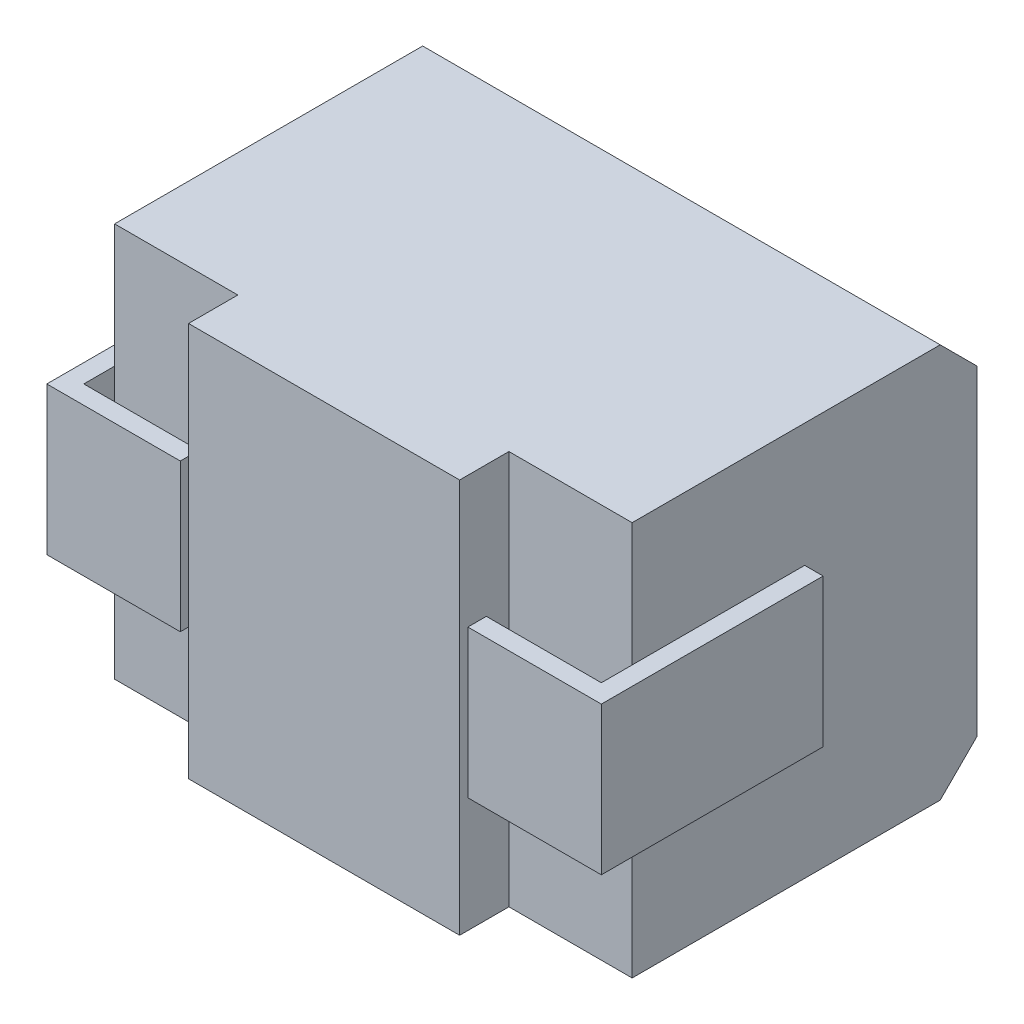
ISO-10303-21;
HEADER;
FILE_DESCRIPTION(('STEP AP214'),'2;1');
FILE_NAME('part.step','',(''),(''),'','','');
FILE_SCHEMA(('AUTOMOTIVE_DESIGN { 1 0 10303 214 1 1 1 1 }'));
ENDSEC;
DATA;
#1=APPLICATION_CONTEXT('core data for automotive mechanical design processes');
#2=APPLICATION_PROTOCOL_DEFINITION('international standard','automotive_design',2000,#1);
#3=PRODUCT_CONTEXT('',#1,'mechanical');
#4=PRODUCT('Part','Part','',(#3));
#5=PRODUCT_RELATED_PRODUCT_CATEGORY('part','',(#4));
#6=PRODUCT_DEFINITION_FORMATION('','',#4);
#7=PRODUCT_DEFINITION_CONTEXT('part definition',#1,'design');
#8=PRODUCT_DEFINITION('design','',#6,#7);
#9=PRODUCT_DEFINITION_SHAPE('','',#8);
#10=(LENGTH_UNIT() NAMED_UNIT(*) SI_UNIT(.MILLI.,.METRE.));
#11=(NAMED_UNIT(*) PLANE_ANGLE_UNIT() SI_UNIT($,.RADIAN.));
#12=(NAMED_UNIT(*) SI_UNIT($,.STERADIAN.) SOLID_ANGLE_UNIT());
#13=UNCERTAINTY_MEASURE_WITH_UNIT(LENGTH_MEASURE(1.E-05),#10,'distance_accuracy_value','');
#14=(GEOMETRIC_REPRESENTATION_CONTEXT(3) GLOBAL_UNCERTAINTY_ASSIGNED_CONTEXT((#13)) GLOBAL_UNIT_ASSIGNED_CONTEXT((#10,
#11,#12)) REPRESENTATION_CONTEXT('',''));
#15=CARTESIAN_POINT('',(0.,0.,0.));
#16=DIRECTION('',(0.,0.,1.));
#17=DIRECTION('',(1.,0.,0.));
#18=AXIS2_PLACEMENT_3D('',#15,#16,#17);
#19=CARTESIAN_POINT('',(0.,3.2,-0.4));
#20=DIRECTION('',(1.,0.,0.));
#21=DIRECTION('',(0.,0.,-1.));
#22=AXIS2_PLACEMENT_3D('',#19,#20,#21);
#23=PLANE('',#22);
#24=DIRECTION('',(0.,-1.,0.));
#25=VECTOR('',#24,1.);
#26=CARTESIAN_POINT('',(0.,3.2,-3.2));
#27=LINE('',#26,#25);
#28=CARTESIAN_POINT('',(0.,2.9,-3.2));
#29=VERTEX_POINT('',#28);
#30=CARTESIAN_POINT('',(0.,0.300000000000001,-3.2));
#31=VERTEX_POINT('',#30);
#32=EDGE_CURVE('E11',#29,#31,#27,.T.);
#33=ORIENTED_EDGE('',*,*,#32,.T.);
#34=DIRECTION('',(0.,-0.707106781186547,0.707106781186549));
#35=VECTOR('',#34,1.);
#36=CARTESIAN_POINT('',(0.,0.3,-3.2));
#37=LINE('',#36,#35);
#38=CARTESIAN_POINT('',(0.,0.,-2.9));
#39=VERTEX_POINT('',#38);
#40=EDGE_CURVE('E24',#31,#39,#37,.T.);
#41=ORIENTED_EDGE('',*,*,#40,.T.);
#42=DIRECTION('',(0.,0.,1.));
#43=VECTOR('',#42,1.);
#44=CARTESIAN_POINT('',(0.,0.,-0.4));
#45=LINE('',#44,#43);
#46=CARTESIAN_POINT('',(0.,0.,-0.4));
#47=VERTEX_POINT('',#46);
#48=EDGE_CURVE('E383',#39,#47,#45,.T.);
#49=ORIENTED_EDGE('',*,*,#48,.T.);
#50=DIRECTION('',(0.,-1.,0.));
#51=VECTOR('',#50,1.);
#52=CARTESIAN_POINT('',(0.,3.2,-0.4));
#53=LINE('',#52,#51);
#54=CARTESIAN_POINT('',(0.,1.,-0.4));
#55=VERTEX_POINT('',#54);
#56=EDGE_CURVE('E380',#55,#47,#53,.T.);
#57=ORIENTED_EDGE('',*,*,#56,.F.);
#58=DIRECTION('',(0.,0.,-1.));
#59=VECTOR('',#58,1.);
#60=CARTESIAN_POINT('',(0.,1.,-0.149999999999998));
#61=LINE('',#60,#59);
#62=CARTESIAN_POINT('',(0.,1.,-1.8));
#63=VERTEX_POINT('',#62);
#64=EDGE_CURVE('E378',#55,#63,#61,.T.);
#65=ORIENTED_EDGE('',*,*,#64,.T.);
#66=DIRECTION('',(0.,1.,0.));
#67=VECTOR('',#66,1.);
#68=CARTESIAN_POINT('',(0.,1.,-1.8));
#69=LINE('',#68,#67);
#70=CARTESIAN_POINT('',(0.,2.2,-1.8));
#71=VERTEX_POINT('',#70);
#72=EDGE_CURVE('E200',#63,#71,#69,.T.);
#73=ORIENTED_EDGE('',*,*,#72,.T.);
#74=DIRECTION('',(0.,0.,-1.));
#75=VECTOR('',#74,1.);
#76=CARTESIAN_POINT('',(0.,2.2,-0.149999999999998));
#77=LINE('',#76,#75);
#78=CARTESIAN_POINT('',(0.,2.2,-0.4));
#79=VERTEX_POINT('',#78);
#80=EDGE_CURVE('E374',#79,#71,#77,.T.);
#81=ORIENTED_EDGE('',*,*,#80,.F.);
#82=DIRECTION('',(0.,-1.,0.));
#83=VECTOR('',#82,1.);
#84=CARTESIAN_POINT('',(0.,3.2,-0.4));
#85=LINE('',#84,#83);
#86=CARTESIAN_POINT('',(0.,3.2,-0.4));
#87=VERTEX_POINT('',#86);
#88=EDGE_CURVE('E371',#87,#79,#85,.T.);
#89=ORIENTED_EDGE('',*,*,#88,.F.);
#90=DIRECTION('',(0.,0.,1.));
#91=VECTOR('',#90,1.);
#92=CARTESIAN_POINT('',(0.,3.2,-0.4));
#93=LINE('',#92,#91);
#94=CARTESIAN_POINT('',(0.,3.2,-2.9));
#95=VERTEX_POINT('',#94);
#96=EDGE_CURVE('E368',#95,#87,#93,.T.);
#97=ORIENTED_EDGE('',*,*,#96,.F.);
#98=DIRECTION('',(0.,-0.707106781186548,-0.707106781186548));
#99=VECTOR('',#98,1.);
#100=CARTESIAN_POINT('',(0.,3.2,-2.9));
#101=LINE('',#100,#99);
#102=EDGE_CURVE('E366',#95,#29,#101,.T.);
#103=ORIENTED_EDGE('',*,*,#102,.T.);
#104=EDGE_LOOP('',(#33,#41,#49,#57,#65,#73,#81,#89,#97,#103));
#105=FACE_BOUND('',#104,.T.);
#106=ADVANCED_FACE('F17',(#105),#23,.F.);
#107=CARTESIAN_POINT('',(4.2,3.2,-0.400000000000001));
#108=DIRECTION('',(-1.,0.,0.));
#109=DIRECTION('',(0.,0.,1.));
#110=AXIS2_PLACEMENT_3D('',#107,#108,#109);
#111=PLANE('',#110);
#112=DIRECTION('',(0.,0.,-1.));
#113=VECTOR('',#112,1.);
#114=CARTESIAN_POINT('',(4.2,0.,-0.400000000000001));
#115=LINE('',#114,#113);
#116=CARTESIAN_POINT('',(4.2,0.,-0.400000000000001));
#117=VERTEX_POINT('',#116);
#118=CARTESIAN_POINT('',(4.2,0.,-2.9));
#119=VERTEX_POINT('',#118);
#120=EDGE_CURVE('E364',#117,#119,#115,.T.);
#121=ORIENTED_EDGE('',*,*,#120,.T.);
#122=DIRECTION('',(0.,0.707106781186547,-0.707106781186549));
#123=VECTOR('',#122,1.);
#124=CARTESIAN_POINT('',(4.2,0.300000000000001,-3.2));
#125=LINE('',#124,#123);
#126=CARTESIAN_POINT('',(4.2,0.3,-3.2));
#127=VERTEX_POINT('',#126);
#128=EDGE_CURVE('E362',#119,#127,#125,.T.);
#129=ORIENTED_EDGE('',*,*,#128,.T.);
#130=DIRECTION('',(0.,-1.,0.));
#131=VECTOR('',#130,1.);
#132=CARTESIAN_POINT('',(4.2,3.2,-3.2));
#133=LINE('',#132,#131);
#134=CARTESIAN_POINT('',(4.2,2.9,-3.2));
#135=VERTEX_POINT('',#134);
#136=EDGE_CURVE('E359',#135,#127,#133,.T.);
#137=ORIENTED_EDGE('',*,*,#136,.F.);
#138=DIRECTION('',(0.,0.707106781186548,0.707106781186548));
#139=VECTOR('',#138,1.);
#140=CARTESIAN_POINT('',(4.2,3.2,-2.9));
#141=LINE('',#140,#139);
#142=CARTESIAN_POINT('',(4.2,3.2,-2.9));
#143=VERTEX_POINT('',#142);
#144=EDGE_CURVE('E357',#135,#143,#141,.T.);
#145=ORIENTED_EDGE('',*,*,#144,.T.);
#146=DIRECTION('',(0.,0.,-1.));
#147=VECTOR('',#146,1.);
#148=CARTESIAN_POINT('',(4.2,3.2,-0.400000000000001));
#149=LINE('',#148,#147);
#150=CARTESIAN_POINT('',(4.2,3.2,-0.400000000000001));
#151=VERTEX_POINT('',#150);
#152=EDGE_CURVE('E354',#151,#143,#149,.T.);
#153=ORIENTED_EDGE('',*,*,#152,.F.);
#154=DIRECTION('',(0.,-1.,0.));
#155=VECTOR('',#154,1.);
#156=CARTESIAN_POINT('',(4.2,3.2,-0.400000000000001));
#157=LINE('',#156,#155);
#158=CARTESIAN_POINT('',(4.2,2.2,-0.400000000000001));
#159=VERTEX_POINT('',#158);
#160=EDGE_CURVE('E352',#151,#159,#157,.T.);
#161=ORIENTED_EDGE('',*,*,#160,.T.);
#162=DIRECTION('',(0.,0.,1.));
#163=VECTOR('',#162,1.);
#164=CARTESIAN_POINT('',(4.2,2.2,-0.15));
#165=LINE('',#164,#163);
#166=CARTESIAN_POINT('',(4.2,2.2,-1.8));
#167=VERTEX_POINT('',#166);
#168=EDGE_CURVE('E349',#167,#159,#165,.T.);
#169=ORIENTED_EDGE('',*,*,#168,.F.);
#170=DIRECTION('',(0.,1.,0.));
#171=VECTOR('',#170,1.);
#172=CARTESIAN_POINT('',(4.2,1.,-1.8));
#173=LINE('',#172,#171);
#174=CARTESIAN_POINT('',(4.2,1.,-1.8));
#175=VERTEX_POINT('',#174);
#176=EDGE_CURVE('E346',#175,#167,#173,.T.);
#177=ORIENTED_EDGE('',*,*,#176,.F.);
#178=DIRECTION('',(0.,0.,1.));
#179=VECTOR('',#178,1.);
#180=CARTESIAN_POINT('',(4.2,1.,-0.15));
#181=LINE('',#180,#179);
#182=CARTESIAN_POINT('',(4.2,1.,-0.400000000000001));
#183=VERTEX_POINT('',#182);
#184=EDGE_CURVE('E344',#175,#183,#181,.T.);
#185=ORIENTED_EDGE('',*,*,#184,.T.);
#186=DIRECTION('',(0.,-1.,0.));
#187=VECTOR('',#186,1.);
#188=CARTESIAN_POINT('',(4.2,3.2,-0.400000000000001));
#189=LINE('',#188,#187);
#190=EDGE_CURVE('E341',#183,#117,#189,.T.);
#191=ORIENTED_EDGE('',*,*,#190,.T.);
#192=EDGE_LOOP('',(#121,#129,#137,#145,#153,#161,#169,#177,#185,#191));
#193=FACE_BOUND('',#192,.T.);
#194=ADVANCED_FACE('F395',(#193),#111,.F.);
#195=CARTESIAN_POINT('',(0.,3.2,-3.2));
#196=DIRECTION('',(0.,0.,1.));
#197=DIRECTION('',(1.,0.,0.));
#198=AXIS2_PLACEMENT_3D('',#195,#196,#197);
#199=PLANE('',#198);
#200=ORIENTED_EDGE('',*,*,#136,.T.);
#201=DIRECTION('',(-1.,0.,0.));
#202=VECTOR('',#201,1.);
#203=CARTESIAN_POINT('',(0.,0.3,-3.2));
#204=LINE('',#203,#202);
#205=EDGE_CURVE('E339',#127,#31,#204,.T.);
#206=ORIENTED_EDGE('',*,*,#205,.T.);
#207=ORIENTED_EDGE('',*,*,#32,.F.);
#208=DIRECTION('',(1.,0.,0.));
#209=VECTOR('',#208,1.);
#210=CARTESIAN_POINT('',(0.,2.9,-3.2));
#211=LINE('',#210,#209);
#212=EDGE_CURVE('E337',#29,#135,#211,.T.);
#213=ORIENTED_EDGE('',*,*,#212,.T.);
#214=EDGE_LOOP('',(#200,#206,#207,#213));
#215=FACE_BOUND('',#214,.T.);
#216=ADVANCED_FACE('F397',(#215),#199,.F.);
#217=CARTESIAN_POINT('',(0.,3.2,-0.4));
#218=DIRECTION('',(0.,0.,-1.));
#219=DIRECTION('',(-1.,0.,0.));
#220=AXIS2_PLACEMENT_3D('',#217,#218,#219);
#221=PLANE('',#220);
#222=DIRECTION('',(1.,0.,0.));
#223=VECTOR('',#222,1.);
#224=CARTESIAN_POINT('',(0.,0.,-0.4));
#225=LINE('',#224,#223);
#226=CARTESIAN_POINT('',(0.999999999999999,0.,-0.4));
#227=VERTEX_POINT('',#226);
#228=EDGE_CURVE('E335',#47,#227,#225,.T.);
#229=ORIENTED_EDGE('',*,*,#228,.T.);
#230=DIRECTION('',(0.,-1.,0.));
#231=VECTOR('',#230,1.);
#232=CARTESIAN_POINT('',(0.999999999999999,3.2,-0.4));
#233=LINE('',#232,#231);
#234=CARTESIAN_POINT('',(0.999999999999999,3.2,-0.4));
#235=VERTEX_POINT('',#234);
#236=EDGE_CURVE('E332',#235,#227,#233,.T.);
#237=ORIENTED_EDGE('',*,*,#236,.F.);
#238=DIRECTION('',(1.,0.,0.));
#239=VECTOR('',#238,1.);
#240=CARTESIAN_POINT('',(0.,3.2,-0.4));
#241=LINE('',#240,#239);
#242=EDGE_CURVE('E329',#87,#235,#241,.T.);
#243=ORIENTED_EDGE('',*,*,#242,.F.);
#244=ORIENTED_EDGE('',*,*,#88,.T.);
#245=DIRECTION('',(0.,-1.,0.));
#246=VECTOR('',#245,1.);
#247=CARTESIAN_POINT('',(0.,3.2,-0.4));
#248=LINE('',#247,#246);
#249=EDGE_CURVE('E326',#79,#55,#248,.T.);
#250=ORIENTED_EDGE('',*,*,#249,.T.);
#251=ORIENTED_EDGE('',*,*,#56,.T.);
#252=EDGE_LOOP('',(#229,#237,#243,#244,#250,#251));
#253=FACE_BOUND('',#252,.T.);
#254=ADVANCED_FACE('F455',(#253),#221,.F.);
#255=CARTESIAN_POINT('',(0.999999999999999,3.2,-0.4));
#256=DIRECTION('',(1.,0.,0.));
#257=DIRECTION('',(0.,0.,-1.));
#258=AXIS2_PLACEMENT_3D('',#255,#256,#257);
#259=PLANE('',#258);
#260=DIRECTION('',(0.,0.,1.));
#261=VECTOR('',#260,1.);
#262=CARTESIAN_POINT('',(0.999999999999999,0.,-0.4));
#263=LINE('',#262,#261);
#264=CARTESIAN_POINT('',(1.,0.,0.));
#265=VERTEX_POINT('',#264);
#266=EDGE_CURVE('E324',#227,#265,#263,.T.);
#267=ORIENTED_EDGE('',*,*,#266,.T.);
#268=DIRECTION('',(0.,-1.,0.));
#269=VECTOR('',#268,1.);
#270=CARTESIAN_POINT('',(1.,3.2,0.));
#271=LINE('',#270,#269);
#272=CARTESIAN_POINT('',(1.,3.2,0.));
#273=VERTEX_POINT('',#272);
#274=EDGE_CURVE('E321',#273,#265,#271,.T.);
#275=ORIENTED_EDGE('',*,*,#274,.F.);
#276=DIRECTION('',(0.,0.,1.));
#277=VECTOR('',#276,1.);
#278=CARTESIAN_POINT('',(0.999999999999999,3.2,-0.4));
#279=LINE('',#278,#277);
#280=EDGE_CURVE('E318',#235,#273,#279,.T.);
#281=ORIENTED_EDGE('',*,*,#280,.F.);
#282=ORIENTED_EDGE('',*,*,#236,.T.);
#283=EDGE_LOOP('',(#267,#275,#281,#282));
#284=FACE_BOUND('',#283,.T.);
#285=ADVANCED_FACE('F460',(#284),#259,.F.);
#286=CARTESIAN_POINT('',(1.,3.2,0.));
#287=DIRECTION('',(0.,0.,-1.));
#288=DIRECTION('',(-1.,0.,0.));
#289=AXIS2_PLACEMENT_3D('',#286,#287,#288);
#290=PLANE('',#289);
#291=DIRECTION('',(1.,0.,0.));
#292=VECTOR('',#291,1.);
#293=CARTESIAN_POINT('',(1.,0.,0.));
#294=LINE('',#293,#292);
#295=CARTESIAN_POINT('',(3.2,0.,0.));
#296=VERTEX_POINT('',#295);
#297=EDGE_CURVE('E316',#265,#296,#294,.T.);
#298=ORIENTED_EDGE('',*,*,#297,.T.);
#299=DIRECTION('',(0.,-1.,0.));
#300=VECTOR('',#299,1.);
#301=CARTESIAN_POINT('',(3.2,3.2,0.));
#302=LINE('',#301,#300);
#303=CARTESIAN_POINT('',(3.2,3.2,0.));
#304=VERTEX_POINT('',#303);
#305=EDGE_CURVE('E313',#304,#296,#302,.T.);
#306=ORIENTED_EDGE('',*,*,#305,.F.);
#307=DIRECTION('',(1.,0.,0.));
#308=VECTOR('',#307,1.);
#309=CARTESIAN_POINT('',(1.,3.2,0.));
#310=LINE('',#309,#308);
#311=EDGE_CURVE('E310',#273,#304,#310,.T.);
#312=ORIENTED_EDGE('',*,*,#311,.F.);
#313=ORIENTED_EDGE('',*,*,#274,.T.);
#314=EDGE_LOOP('',(#298,#306,#312,#313));
#315=FACE_BOUND('',#314,.T.);
#316=ADVANCED_FACE('F464',(#315),#290,.F.);
#317=CARTESIAN_POINT('',(3.2,3.2,-0.4));
#318=DIRECTION('',(-1.,0.,0.));
#319=DIRECTION('',(0.,0.,1.));
#320=AXIS2_PLACEMENT_3D('',#317,#318,#319);
#321=PLANE('',#320);
#322=DIRECTION('',(0.,0.,-1.));
#323=VECTOR('',#322,1.);
#324=CARTESIAN_POINT('',(3.2,0.,-0.4));
#325=LINE('',#324,#323);
#326=CARTESIAN_POINT('',(3.2,0.,-0.4));
#327=VERTEX_POINT('',#326);
#328=EDGE_CURVE('E308',#296,#327,#325,.T.);
#329=ORIENTED_EDGE('',*,*,#328,.T.);
#330=DIRECTION('',(0.,-1.,0.));
#331=VECTOR('',#330,1.);
#332=CARTESIAN_POINT('',(3.2,3.2,-0.4));
#333=LINE('',#332,#331);
#334=CARTESIAN_POINT('',(3.2,3.2,-0.4));
#335=VERTEX_POINT('',#334);
#336=EDGE_CURVE('E305',#335,#327,#333,.T.);
#337=ORIENTED_EDGE('',*,*,#336,.F.);
#338=DIRECTION('',(0.,0.,-1.));
#339=VECTOR('',#338,1.);
#340=CARTESIAN_POINT('',(3.2,3.2,-0.4));
#341=LINE('',#340,#339);
#342=EDGE_CURVE('E302',#304,#335,#341,.T.);
#343=ORIENTED_EDGE('',*,*,#342,.F.);
#344=ORIENTED_EDGE('',*,*,#305,.T.);
#345=EDGE_LOOP('',(#329,#337,#343,#344));
#346=FACE_BOUND('',#345,.T.);
#347=ADVANCED_FACE('F468',(#346),#321,.F.);
#348=CARTESIAN_POINT('',(4.2,3.2,-0.400000000000001));
#349=DIRECTION('',(0.,0.,-1.));
#350=DIRECTION('',(-1.,0.,0.));
#351=AXIS2_PLACEMENT_3D('',#348,#349,#350);
#352=PLANE('',#351);
#353=DIRECTION('',(1.,0.,0.));
#354=VECTOR('',#353,1.);
#355=CARTESIAN_POINT('',(4.2,0.,-0.400000000000001));
#356=LINE('',#355,#354);
#357=EDGE_CURVE('E299',#327,#117,#356,.T.);
#358=ORIENTED_EDGE('',*,*,#357,.T.);
#359=ORIENTED_EDGE('',*,*,#190,.F.);
#360=DIRECTION('',(0.,-1.,0.));
#361=VECTOR('',#360,1.);
#362=CARTESIAN_POINT('',(4.2,3.2,-0.400000000000001));
#363=LINE('',#362,#361);
#364=EDGE_CURVE('E296',#159,#183,#363,.T.);
#365=ORIENTED_EDGE('',*,*,#364,.F.);
#366=ORIENTED_EDGE('',*,*,#160,.F.);
#367=DIRECTION('',(1.,0.,0.));
#368=VECTOR('',#367,1.);
#369=CARTESIAN_POINT('',(4.2,3.2,-0.400000000000001));
#370=LINE('',#369,#368);
#371=EDGE_CURVE('E293',#335,#151,#370,.T.);
#372=ORIENTED_EDGE('',*,*,#371,.F.);
#373=ORIENTED_EDGE('',*,*,#336,.T.);
#374=EDGE_LOOP('',(#358,#359,#365,#366,#372,#373));
#375=FACE_BOUND('',#374,.T.);
#376=ADVANCED_FACE('F409',(#375),#352,.F.);
#377=CARTESIAN_POINT('',(4.2,3.2,-3.2));
#378=DIRECTION('',(0.,-1.,0.));
#379=DIRECTION('',(0.,0.,-1.));
#380=AXIS2_PLACEMENT_3D('',#377,#378,#379);
#381=PLANE('',#380);
#382=ORIENTED_EDGE('',*,*,#152,.T.);
#383=DIRECTION('',(-1.,0.,0.));
#384=VECTOR('',#383,1.);
#385=CARTESIAN_POINT('',(4.2,3.2,-2.9));
#386=LINE('',#385,#384);
#387=EDGE_CURVE('E290',#143,#95,#386,.T.);
#388=ORIENTED_EDGE('',*,*,#387,.T.);
#389=ORIENTED_EDGE('',*,*,#96,.T.);
#390=ORIENTED_EDGE('',*,*,#242,.T.);
#391=ORIENTED_EDGE('',*,*,#280,.T.);
#392=ORIENTED_EDGE('',*,*,#311,.T.);
#393=ORIENTED_EDGE('',*,*,#342,.T.);
#394=ORIENTED_EDGE('',*,*,#371,.T.);
#395=EDGE_LOOP('',(#382,#388,#389,#390,#391,#392,#393,#394));
#396=FACE_BOUND('',#395,.T.);
#397=ADVANCED_FACE('F405',(#396),#381,.F.);
#398=CARTESIAN_POINT('',(4.2,0.,-3.2));
#399=DIRECTION('',(0.,-1.,0.));
#400=DIRECTION('',(0.,0.,-1.));
#401=AXIS2_PLACEMENT_3D('',#398,#399,#400);
#402=PLANE('',#401);
#403=ORIENTED_EDGE('',*,*,#48,.F.);
#404=DIRECTION('',(1.,0.,0.));
#405=VECTOR('',#404,1.);
#406=CARTESIAN_POINT('',(4.2,0.,-2.9));
#407=LINE('',#406,#405);
#408=EDGE_CURVE('E287',#39,#119,#407,.T.);
#409=ORIENTED_EDGE('',*,*,#408,.T.);
#410=ORIENTED_EDGE('',*,*,#120,.F.);
#411=ORIENTED_EDGE('',*,*,#357,.F.);
#412=ORIENTED_EDGE('',*,*,#328,.F.);
#413=ORIENTED_EDGE('',*,*,#297,.F.);
#414=ORIENTED_EDGE('',*,*,#266,.F.);
#415=ORIENTED_EDGE('',*,*,#228,.F.);
#416=EDGE_LOOP('',(#403,#409,#410,#411,#412,#413,#414,#415));
#417=FACE_BOUND('',#416,.T.);
#418=ADVANCED_FACE('F390',(#417),#402,.T.);
#419=CARTESIAN_POINT('',(4.2,1.,-0.15));
#420=DIRECTION('',(-1.,0.,0.));
#421=DIRECTION('',(0.,0.,1.));
#422=AXIS2_PLACEMENT_3D('',#419,#420,#421);
#423=PLANE('',#422);
#424=ORIENTED_EDGE('',*,*,#364,.T.);
#425=DIRECTION('',(0.,0.,1.));
#426=VECTOR('',#425,1.);
#427=CARTESIAN_POINT('',(4.2,1.,-0.15));
#428=LINE('',#427,#426);
#429=CARTESIAN_POINT('',(4.2,1.,-0.15));
#430=VERTEX_POINT('',#429);
#431=EDGE_CURVE('E285',#183,#430,#428,.T.);
#432=ORIENTED_EDGE('',*,*,#431,.T.);
#433=DIRECTION('',(0.,1.,0.));
#434=VECTOR('',#433,1.);
#435=CARTESIAN_POINT('',(4.2,1.,-0.15));
#436=LINE('',#435,#434);
#437=CARTESIAN_POINT('',(4.2,2.2,-0.15));
#438=VERTEX_POINT('',#437);
#439=EDGE_CURVE('E283',#430,#438,#436,.T.);
#440=ORIENTED_EDGE('',*,*,#439,.T.);
#441=DIRECTION('',(0.,0.,1.));
#442=VECTOR('',#441,1.);
#443=CARTESIAN_POINT('',(4.2,2.2,-0.15));
#444=LINE('',#443,#442);
#445=EDGE_CURVE('E280',#159,#438,#444,.T.);
#446=ORIENTED_EDGE('',*,*,#445,.F.);
#447=EDGE_LOOP('',(#424,#432,#440,#446));
#448=FACE_BOUND('',#447,.T.);
#449=ADVANCED_FACE('F438',(#448),#423,.T.);
#450=CARTESIAN_POINT('',(4.2,1.,-1.8));
#451=DIRECTION('',(0.,0.,-1.));
#452=DIRECTION('',(-1.,0.,0.));
#453=AXIS2_PLACEMENT_3D('',#450,#451,#452);
#454=PLANE('',#453);
#455=ORIENTED_EDGE('',*,*,#176,.T.);
#456=DIRECTION('',(-1.,0.,0.));
#457=VECTOR('',#456,1.);
#458=CARTESIAN_POINT('',(4.2,2.2,-1.8));
#459=LINE('',#458,#457);
#460=CARTESIAN_POINT('',(4.35,2.2,-1.8));
#461=VERTEX_POINT('',#460);
#462=EDGE_CURVE('E277',#461,#167,#459,.T.);
#463=ORIENTED_EDGE('',*,*,#462,.F.);
#464=DIRECTION('',(0.,1.,0.));
#465=VECTOR('',#464,1.);
#466=CARTESIAN_POINT('',(4.35,1.,-1.8));
#467=LINE('',#466,#465);
#468=CARTESIAN_POINT('',(4.35,1.,-1.8));
#469=VERTEX_POINT('',#468);
#470=EDGE_CURVE('E274',#469,#461,#467,.T.);
#471=ORIENTED_EDGE('',*,*,#470,.F.);
#472=DIRECTION('',(-1.,0.,0.));
#473=VECTOR('',#472,1.);
#474=CARTESIAN_POINT('',(4.2,1.,-1.8));
#475=LINE('',#474,#473);
#476=EDGE_CURVE('E271',#469,#175,#475,.T.);
#477=ORIENTED_EDGE('',*,*,#476,.T.);
#478=EDGE_LOOP('',(#455,#463,#471,#477));
#479=FACE_BOUND('',#478,.T.);
#480=ADVANCED_FACE('F418',(#479),#454,.T.);
#481=CARTESIAN_POINT('',(4.35,1.,-1.8));
#482=DIRECTION('',(1.,0.,0.));
#483=DIRECTION('',(0.,0.,-1.));
#484=AXIS2_PLACEMENT_3D('',#481,#482,#483);
#485=PLANE('',#484);
#486=ORIENTED_EDGE('',*,*,#470,.T.);
#487=DIRECTION('',(0.,0.,-1.));
#488=VECTOR('',#487,1.);
#489=CARTESIAN_POINT('',(4.35,2.2,-1.8));
#490=LINE('',#489,#488);
#491=CARTESIAN_POINT('',(4.35,2.2,0.));
#492=VERTEX_POINT('',#491);
#493=EDGE_CURVE('E268',#492,#461,#490,.T.);
#494=ORIENTED_EDGE('',*,*,#493,.F.);
#495=DIRECTION('',(0.,1.,0.));
#496=VECTOR('',#495,1.);
#497=CARTESIAN_POINT('',(4.35,1.,0.));
#498=LINE('',#497,#496);
#499=CARTESIAN_POINT('',(4.35,1.,0.));
#500=VERTEX_POINT('',#499);
#501=EDGE_CURVE('E265',#500,#492,#498,.T.);
#502=ORIENTED_EDGE('',*,*,#501,.F.);
#503=DIRECTION('',(0.,0.,-1.));
#504=VECTOR('',#503,1.);
#505=CARTESIAN_POINT('',(4.35,1.,-1.8));
#506=LINE('',#505,#504);
#507=EDGE_CURVE('E262',#500,#469,#506,.T.);
#508=ORIENTED_EDGE('',*,*,#507,.T.);
#509=EDGE_LOOP('',(#486,#494,#502,#508));
#510=FACE_BOUND('',#509,.T.);
#511=ADVANCED_FACE('F421',(#510),#485,.T.);
#512=CARTESIAN_POINT('',(4.35,1.,0.));
#513=DIRECTION('',(0.,0.,1.));
#514=DIRECTION('',(1.,0.,0.));
#515=AXIS2_PLACEMENT_3D('',#512,#513,#514);
#516=PLANE('',#515);
#517=ORIENTED_EDGE('',*,*,#501,.T.);
#518=DIRECTION('',(1.,0.,0.));
#519=VECTOR('',#518,1.);
#520=CARTESIAN_POINT('',(4.35,2.2,0.));
#521=LINE('',#520,#519);
#522=CARTESIAN_POINT('',(3.26680784871361,2.2,0.));
#523=VERTEX_POINT('',#522);
#524=EDGE_CURVE('E259',#523,#492,#521,.T.);
#525=ORIENTED_EDGE('',*,*,#524,.F.);
#526=DIRECTION('',(0.,1.,0.));
#527=VECTOR('',#526,1.);
#528=CARTESIAN_POINT('',(3.26680784871361,1.,0.));
#529=LINE('',#528,#527);
#530=CARTESIAN_POINT('',(3.26680784871361,1.,0.));
#531=VERTEX_POINT('',#530);
#532=EDGE_CURVE('E256',#531,#523,#529,.T.);
#533=ORIENTED_EDGE('',*,*,#532,.F.);
#534=DIRECTION('',(1.,0.,0.));
#535=VECTOR('',#534,1.);
#536=CARTESIAN_POINT('',(4.35,1.,0.));
#537=LINE('',#536,#535);
#538=EDGE_CURVE('E253',#531,#500,#537,.T.);
#539=ORIENTED_EDGE('',*,*,#538,.T.);
#540=EDGE_LOOP('',(#517,#525,#533,#539));
#541=FACE_BOUND('',#540,.T.);
#542=ADVANCED_FACE('F429',(#541),#516,.T.);
#543=CARTESIAN_POINT('',(3.26680784871361,1.,0.));
#544=DIRECTION('',(-1.,0.,0.));
#545=DIRECTION('',(0.,0.,1.));
#546=AXIS2_PLACEMENT_3D('',#543,#544,#545);
#547=PLANE('',#546);
#548=ORIENTED_EDGE('',*,*,#532,.T.);
#549=DIRECTION('',(0.,0.,1.));
#550=VECTOR('',#549,1.);
#551=CARTESIAN_POINT('',(3.26680784871361,2.2,0.));
#552=LINE('',#551,#550);
#553=CARTESIAN_POINT('',(3.26680784871361,2.2,-0.15));
#554=VERTEX_POINT('',#553);
#555=EDGE_CURVE('E250',#554,#523,#552,.T.);
#556=ORIENTED_EDGE('',*,*,#555,.F.);
#557=DIRECTION('',(0.,1.,0.));
#558=VECTOR('',#557,1.);
#559=CARTESIAN_POINT('',(3.26680784871361,1.,-0.15));
#560=LINE('',#559,#558);
#561=CARTESIAN_POINT('',(3.26680784871361,1.,-0.15));
#562=VERTEX_POINT('',#561);
#563=EDGE_CURVE('E247',#562,#554,#560,.T.);
#564=ORIENTED_EDGE('',*,*,#563,.F.);
#565=DIRECTION('',(0.,0.,1.));
#566=VECTOR('',#565,1.);
#567=CARTESIAN_POINT('',(3.26680784871361,1.,0.));
#568=LINE('',#567,#566);
#569=EDGE_CURVE('E244',#562,#531,#568,.T.);
#570=ORIENTED_EDGE('',*,*,#569,.T.);
#571=EDGE_LOOP('',(#548,#556,#564,#570));
#572=FACE_BOUND('',#571,.T.);
#573=ADVANCED_FACE('F431',(#572),#547,.T.);
#574=CARTESIAN_POINT('',(3.26680784871361,1.,-0.15));
#575=DIRECTION('',(0.,0.,-1.));
#576=DIRECTION('',(-1.,0.,0.));
#577=AXIS2_PLACEMENT_3D('',#574,#575,#576);
#578=PLANE('',#577);
#579=ORIENTED_EDGE('',*,*,#563,.T.);
#580=DIRECTION('',(-1.,0.,0.));
#581=VECTOR('',#580,1.);
#582=CARTESIAN_POINT('',(3.26680784871361,2.2,-0.15));
#583=LINE('',#582,#581);
#584=EDGE_CURVE('E241',#438,#554,#583,.T.);
#585=ORIENTED_EDGE('',*,*,#584,.F.);
#586=ORIENTED_EDGE('',*,*,#439,.F.);
#587=DIRECTION('',(-1.,0.,0.));
#588=VECTOR('',#587,1.);
#589=CARTESIAN_POINT('',(3.26680784871361,1.,-0.15));
#590=LINE('',#589,#588);
#591=EDGE_CURVE('E238',#430,#562,#590,.T.);
#592=ORIENTED_EDGE('',*,*,#591,.T.);
#593=EDGE_LOOP('',(#579,#585,#586,#592));
#594=FACE_BOUND('',#593,.T.);
#595=ADVANCED_FACE('F434',(#594),#578,.T.);
#596=CARTESIAN_POINT('',(0.,1.,0.));
#597=DIRECTION('',(0.,-1.,0.));
#598=DIRECTION('',(0.,0.,-1.));
#599=AXIS2_PLACEMENT_3D('',#596,#597,#598);
#600=PLANE('',#599);
#601=ORIENTED_EDGE('',*,*,#184,.F.);
#602=ORIENTED_EDGE('',*,*,#476,.F.);
#603=ORIENTED_EDGE('',*,*,#507,.F.);
#604=ORIENTED_EDGE('',*,*,#538,.F.);
#605=ORIENTED_EDGE('',*,*,#569,.F.);
#606=ORIENTED_EDGE('',*,*,#591,.F.);
#607=ORIENTED_EDGE('',*,*,#431,.F.);
#608=EDGE_LOOP('',(#601,#602,#603,#604,#605,#606,#607));
#609=FACE_BOUND('',#608,.T.);
#610=ADVANCED_FACE('F426',(#609),#600,.T.);
#611=CARTESIAN_POINT('',(0.,2.2,0.));
#612=DIRECTION('',(0.,-1.,0.));
#613=DIRECTION('',(0.,0.,-1.));
#614=AXIS2_PLACEMENT_3D('',#611,#612,#613);
#615=PLANE('',#614);
#616=ORIENTED_EDGE('',*,*,#168,.T.);
#617=ORIENTED_EDGE('',*,*,#445,.T.);
#618=ORIENTED_EDGE('',*,*,#584,.T.);
#619=ORIENTED_EDGE('',*,*,#555,.T.);
#620=ORIENTED_EDGE('',*,*,#524,.T.);
#621=ORIENTED_EDGE('',*,*,#493,.T.);
#622=ORIENTED_EDGE('',*,*,#462,.T.);
#623=EDGE_LOOP('',(#616,#617,#618,#619,#620,#621,#622));
#624=FACE_BOUND('',#623,.T.);
#625=ADVANCED_FACE('F415',(#624),#615,.F.);
#626=CARTESIAN_POINT('',(0.,1.,-0.149999999999998));
#627=DIRECTION('',(1.,0.,0.));
#628=DIRECTION('',(0.,0.,-1.));
#629=AXIS2_PLACEMENT_3D('',#626,#627,#628);
#630=PLANE('',#629);
#631=ORIENTED_EDGE('',*,*,#249,.F.);
#632=DIRECTION('',(0.,0.,-1.));
#633=VECTOR('',#632,1.);
#634=CARTESIAN_POINT('',(0.,2.2,-0.149999999999998));
#635=LINE('',#634,#633);
#636=CARTESIAN_POINT('',(0.,2.2,-0.149999999999998));
#637=VERTEX_POINT('',#636);
#638=EDGE_CURVE('E235',#637,#79,#635,.T.);
#639=ORIENTED_EDGE('',*,*,#638,.F.);
#640=DIRECTION('',(0.,1.,0.));
#641=VECTOR('',#640,1.);
#642=CARTESIAN_POINT('',(0.,1.,-0.149999999999998));
#643=LINE('',#642,#641);
#644=CARTESIAN_POINT('',(0.,1.,-0.149999999999998));
#645=VERTEX_POINT('',#644);
#646=EDGE_CURVE('E232',#645,#637,#643,.T.);
#647=ORIENTED_EDGE('',*,*,#646,.F.);
#648=DIRECTION('',(0.,0.,-1.));
#649=VECTOR('',#648,1.);
#650=CARTESIAN_POINT('',(0.,1.,-0.149999999999998));
#651=LINE('',#650,#649);
#652=EDGE_CURVE('E229',#645,#55,#651,.T.);
#653=ORIENTED_EDGE('',*,*,#652,.T.);
#654=EDGE_LOOP('',(#631,#639,#647,#653));
#655=FACE_BOUND('',#654,.T.);
#656=ADVANCED_FACE('F550',(#655),#630,.T.);
#657=CARTESIAN_POINT('',(0.933192151286397,1.,-0.149999999999999));
#658=DIRECTION('',(0.,0.,-1.));
#659=DIRECTION('',(-1.,0.,0.));
#660=AXIS2_PLACEMENT_3D('',#657,#658,#659);
#661=PLANE('',#660);
#662=ORIENTED_EDGE('',*,*,#646,.T.);
#663=DIRECTION('',(-1.,0.,0.));
#664=VECTOR('',#663,1.);
#665=CARTESIAN_POINT('',(0.933192151286397,2.2,-0.149999999999999));
#666=LINE('',#665,#664);
#667=CARTESIAN_POINT('',(0.933192151286397,2.2,-0.149999999999999));
#668=VERTEX_POINT('',#667);
#669=EDGE_CURVE('E226',#668,#637,#666,.T.);
#670=ORIENTED_EDGE('',*,*,#669,.F.);
#671=DIRECTION('',(0.,1.,0.));
#672=VECTOR('',#671,1.);
#673=CARTESIAN_POINT('',(0.933192151286397,1.,-0.149999999999999));
#674=LINE('',#673,#672);
#675=CARTESIAN_POINT('',(0.933192151286397,1.,-0.149999999999999));
#676=VERTEX_POINT('',#675);
#677=EDGE_CURVE('E223',#676,#668,#674,.T.);
#678=ORIENTED_EDGE('',*,*,#677,.F.);
#679=DIRECTION('',(-1.,0.,0.));
#680=VECTOR('',#679,1.);
#681=CARTESIAN_POINT('',(0.933192151286397,1.,-0.149999999999999));
#682=LINE('',#681,#680);
#683=EDGE_CURVE('E220',#676,#645,#682,.T.);
#684=ORIENTED_EDGE('',*,*,#683,.T.);
#685=EDGE_LOOP('',(#662,#670,#678,#684));
#686=FACE_BOUND('',#685,.T.);
#687=ADVANCED_FACE('F559',(#686),#661,.T.);
#688=CARTESIAN_POINT('',(0.933192151286397,1.,0.));
#689=DIRECTION('',(1.,0.,0.));
#690=DIRECTION('',(0.,0.,-1.));
#691=AXIS2_PLACEMENT_3D('',#688,#689,#690);
#692=PLANE('',#691);
#693=ORIENTED_EDGE('',*,*,#677,.T.);
#694=DIRECTION('',(0.,0.,-1.));
#695=VECTOR('',#694,1.);
#696=CARTESIAN_POINT('',(0.933192151286397,2.2,0.));
#697=LINE('',#696,#695);
#698=CARTESIAN_POINT('',(0.933192151286397,2.2,0.));
#699=VERTEX_POINT('',#698);
#700=EDGE_CURVE('E217',#699,#668,#697,.T.);
#701=ORIENTED_EDGE('',*,*,#700,.F.);
#702=DIRECTION('',(0.,1.,0.));
#703=VECTOR('',#702,1.);
#704=CARTESIAN_POINT('',(0.933192151286397,1.,0.));
#705=LINE('',#704,#703);
#706=CARTESIAN_POINT('',(0.933192151286397,1.,0.));
#707=VERTEX_POINT('',#706);
#708=EDGE_CURVE('E214',#707,#699,#705,.T.);
#709=ORIENTED_EDGE('',*,*,#708,.F.);
#710=DIRECTION('',(0.,0.,-1.));
#711=VECTOR('',#710,1.);
#712=CARTESIAN_POINT('',(0.933192151286397,1.,0.));
#713=LINE('',#712,#711);
#714=EDGE_CURVE('E211',#707,#676,#713,.T.);
#715=ORIENTED_EDGE('',*,*,#714,.T.);
#716=EDGE_LOOP('',(#693,#701,#709,#715));
#717=FACE_BOUND('',#716,.T.);
#718=ADVANCED_FACE('F569',(#717),#692,.T.);
#719=CARTESIAN_POINT('',(-0.149999999999999,1.,0.));
#720=DIRECTION('',(0.,0.,1.));
#721=DIRECTION('',(1.,0.,0.));
#722=AXIS2_PLACEMENT_3D('',#719,#720,#721);
#723=PLANE('',#722);
#724=ORIENTED_EDGE('',*,*,#708,.T.);
#725=DIRECTION('',(1.,0.,0.));
#726=VECTOR('',#725,1.);
#727=CARTESIAN_POINT('',(-0.149999999999999,2.2,0.));
#728=LINE('',#727,#726);
#729=CARTESIAN_POINT('',(-0.149999999999999,2.2,0.));
#730=VERTEX_POINT('',#729);
#731=EDGE_CURVE('E208',#730,#699,#728,.T.);
#732=ORIENTED_EDGE('',*,*,#731,.F.);
#733=DIRECTION('',(0.,1.,0.));
#734=VECTOR('',#733,1.);
#735=CARTESIAN_POINT('',(-0.149999999999999,1.,0.));
#736=LINE('',#735,#734);
#737=CARTESIAN_POINT('',(-0.149999999999999,1.,0.));
#738=VERTEX_POINT('',#737);
#739=EDGE_CURVE('E206',#738,#730,#736,.T.);
#740=ORIENTED_EDGE('',*,*,#739,.F.);
#741=DIRECTION('',(1.,0.,0.));
#742=VECTOR('',#741,1.);
#743=CARTESIAN_POINT('',(-0.149999999999999,1.,0.));
#744=LINE('',#743,#742);
#745=EDGE_CURVE('E195',#738,#707,#744,.T.);
#746=ORIENTED_EDGE('',*,*,#745,.T.);
#747=EDGE_LOOP('',(#724,#732,#740,#746));
#748=FACE_BOUND('',#747,.T.);
#749=ADVANCED_FACE('F579',(#748),#723,.T.);
#750=CARTESIAN_POINT('',(-0.150000000000001,1.,-1.8));
#751=DIRECTION('',(-1.,0.,0.));
#752=DIRECTION('',(0.,0.,1.));
#753=AXIS2_PLACEMENT_3D('',#750,#751,#752);
#754=PLANE('',#753);
#755=ORIENTED_EDGE('',*,*,#739,.T.);
#756=DIRECTION('',(0.,0.,1.));
#757=VECTOR('',#756,1.);
#758=CARTESIAN_POINT('',(-0.150000000000001,2.2,-1.8));
#759=LINE('',#758,#757);
#760=CARTESIAN_POINT('',(-0.150000000000001,2.2,-1.8));
#761=VERTEX_POINT('',#760);
#762=EDGE_CURVE('E180',#761,#730,#759,.T.);
#763=ORIENTED_EDGE('',*,*,#762,.F.);
#764=DIRECTION('',(0.,1.,0.));
#765=VECTOR('',#764,1.);
#766=CARTESIAN_POINT('',(-0.150000000000001,1.,-1.8));
#767=LINE('',#766,#765);
#768=CARTESIAN_POINT('',(-0.150000000000001,1.,-1.8));
#769=VERTEX_POINT('',#768);
#770=EDGE_CURVE('E174',#769,#761,#767,.T.);
#771=ORIENTED_EDGE('',*,*,#770,.F.);
#772=DIRECTION('',(0.,0.,1.));
#773=VECTOR('',#772,1.);
#774=CARTESIAN_POINT('',(-0.150000000000001,1.,-1.8));
#775=LINE('',#774,#773);
#776=EDGE_CURVE('E178',#769,#738,#775,.T.);
#777=ORIENTED_EDGE('',*,*,#776,.T.);
#778=EDGE_LOOP('',(#755,#763,#771,#777));
#779=FACE_BOUND('',#778,.T.);
#780=ADVANCED_FACE('F177',(#779),#754,.T.);
#781=CARTESIAN_POINT('',(0.,1.,-1.8));
#782=DIRECTION('',(0.,0.,-1.));
#783=DIRECTION('',(-1.,0.,0.));
#784=AXIS2_PLACEMENT_3D('',#781,#782,#783);
#785=PLANE('',#784);
#786=ORIENTED_EDGE('',*,*,#770,.T.);
#787=DIRECTION('',(-1.,0.,0.));
#788=VECTOR('',#787,1.);
#789=CARTESIAN_POINT('',(0.,2.2,-1.8));
#790=LINE('',#789,#788);
#791=EDGE_CURVE('E196',#71,#761,#790,.T.);
#792=ORIENTED_EDGE('',*,*,#791,.F.);
#793=ORIENTED_EDGE('',*,*,#72,.F.);
#794=DIRECTION('',(-1.,0.,0.));
#795=VECTOR('',#794,1.);
#796=CARTESIAN_POINT('',(0.,1.,-1.8));
#797=LINE('',#796,#795);
#798=EDGE_CURVE('E192',#63,#769,#797,.T.);
#799=ORIENTED_EDGE('',*,*,#798,.T.);
#800=EDGE_LOOP('',(#786,#792,#793,#799));
#801=FACE_BOUND('',#800,.T.);
#802=ADVANCED_FACE('F199',(#801),#785,.T.);
#803=CARTESIAN_POINT('',(0.,1.,0.));
#804=DIRECTION('',(0.,1.,0.));
#805=DIRECTION('',(0.,0.,1.));
#806=AXIS2_PLACEMENT_3D('',#803,#804,#805);
#807=PLANE('',#806);
#808=ORIENTED_EDGE('',*,*,#652,.F.);
#809=ORIENTED_EDGE('',*,*,#683,.F.);
#810=ORIENTED_EDGE('',*,*,#714,.F.);
#811=ORIENTED_EDGE('',*,*,#745,.F.);
#812=ORIENTED_EDGE('',*,*,#776,.F.);
#813=ORIENTED_EDGE('',*,*,#798,.F.);
#814=ORIENTED_EDGE('',*,*,#64,.F.);
#815=EDGE_LOOP('',(#808,#809,#810,#811,#812,#813,#814));
#816=FACE_BOUND('',#815,.T.);
#817=ADVANCED_FACE('F190',(#816),#807,.F.);
#818=CARTESIAN_POINT('',(0.,2.2,0.));
#819=DIRECTION('',(0.,1.,0.));
#820=DIRECTION('',(0.,0.,1.));
#821=AXIS2_PLACEMENT_3D('',#818,#819,#820);
#822=PLANE('',#821);
#823=ORIENTED_EDGE('',*,*,#638,.T.);
#824=ORIENTED_EDGE('',*,*,#80,.T.);
#825=ORIENTED_EDGE('',*,*,#791,.T.);
#826=ORIENTED_EDGE('',*,*,#762,.T.);
#827=ORIENTED_EDGE('',*,*,#731,.T.);
#828=ORIENTED_EDGE('',*,*,#700,.T.);
#829=ORIENTED_EDGE('',*,*,#669,.T.);
#830=EDGE_LOOP('',(#823,#824,#825,#826,#827,#828,#829));
#831=FACE_BOUND('',#830,.T.);
#832=ADVANCED_FACE('F614',(#831),#822,.T.);
#833=CARTESIAN_POINT('',(0.,0.3,-3.2));
#834=DIRECTION('',(0.,-0.707106781186549,-0.707106781186547));
#835=DIRECTION('',(1.,0.,0.));
#836=AXIS2_PLACEMENT_3D('',#833,#834,#835);
#837=PLANE('',#836);
#838=ORIENTED_EDGE('',*,*,#128,.F.);
#839=ORIENTED_EDGE('',*,*,#408,.F.);
#840=ORIENTED_EDGE('',*,*,#40,.F.);
#841=ORIENTED_EDGE('',*,*,#205,.F.);
#842=EDGE_LOOP('',(#838,#839,#840,#841));
#843=FACE_BOUND('',#842,.T.);
#844=ADVANCED_FACE('F393',(#843),#837,.T.);
#845=CARTESIAN_POINT('',(4.2,3.2,-2.9));
#846=DIRECTION('',(0.,-0.707106781186548,0.707106781186548));
#847=DIRECTION('',(-1.,0.,0.));
#848=AXIS2_PLACEMENT_3D('',#845,#846,#847);
#849=PLANE('',#848);
#850=ORIENTED_EDGE('',*,*,#144,.F.);
#851=ORIENTED_EDGE('',*,*,#212,.F.);
#852=ORIENTED_EDGE('',*,*,#102,.F.);
#853=ORIENTED_EDGE('',*,*,#387,.F.);
#854=EDGE_LOOP('',(#850,#851,#852,#853));
#855=FACE_BOUND('',#854,.T.);
#856=ADVANCED_FACE('F401',(#855),#849,.F.);
#857=CLOSED_SHELL('',(#106,#194,#216,#254,#285,#316,#347,#376,#397,#418,#449,#480,#511,#542,
#573,#595,#610,#625,#656,#687,#718,#749,#780,#802,#817,#832,#844,#856));
#858=MANIFOLD_SOLID_BREP('B1',#857);
#859=ADVANCED_BREP_SHAPE_REPRESENTATION('',(#18,#858),#14);
#860=SHAPE_DEFINITION_REPRESENTATION(#9,#859);
ENDSEC;
END-ISO-10303-21;
